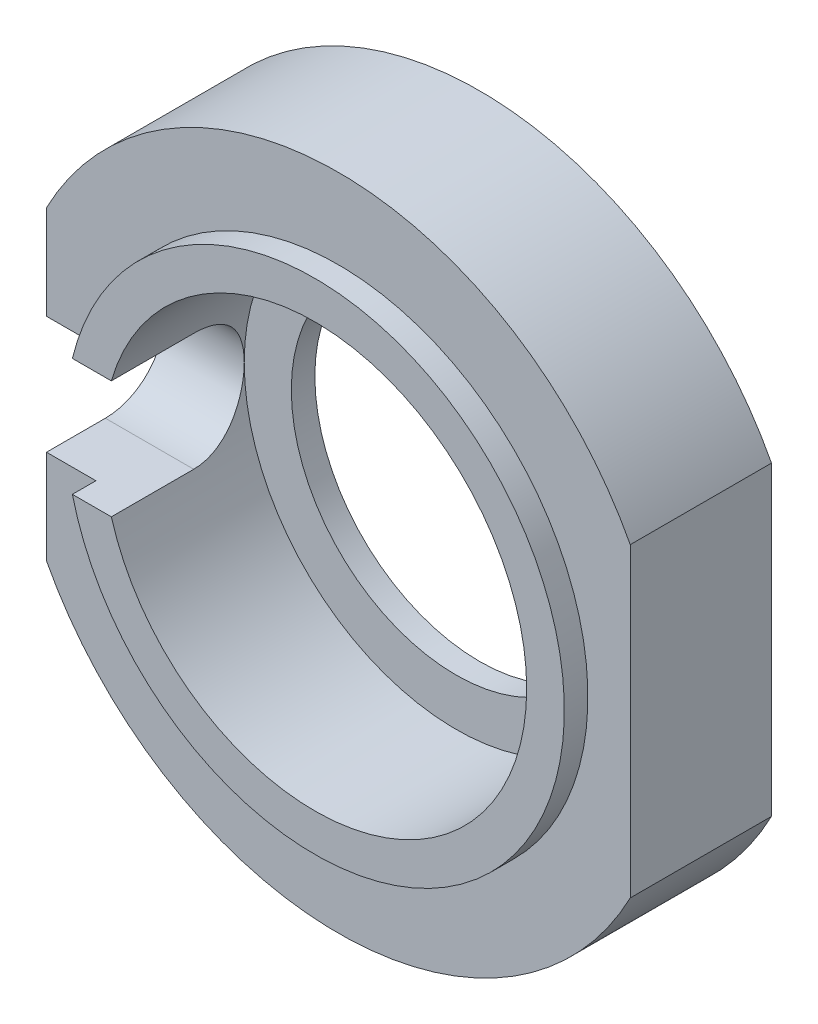
ISO-10303-21;
HEADER;
FILE_DESCRIPTION(('STEP AP214'),'2;1');
FILE_NAME('part.step','',(''),(''),'','','');
FILE_SCHEMA(('AUTOMOTIVE_DESIGN { 1 0 10303 214 1 1 1 1 }'));
ENDSEC;
DATA;
#1=APPLICATION_CONTEXT('core data for automotive mechanical design processes');
#2=APPLICATION_PROTOCOL_DEFINITION('international standard','automotive_design',2000,#1);
#3=PRODUCT_CONTEXT('',#1,'mechanical');
#4=PRODUCT('Part','Part','',(#3));
#5=PRODUCT_RELATED_PRODUCT_CATEGORY('part','',(#4));
#6=PRODUCT_DEFINITION_FORMATION('','',#4);
#7=PRODUCT_DEFINITION_CONTEXT('part definition',#1,'design');
#8=PRODUCT_DEFINITION('design','',#6,#7);
#9=PRODUCT_DEFINITION_SHAPE('','',#8);
#10=(LENGTH_UNIT() NAMED_UNIT(*) SI_UNIT(.MILLI.,.METRE.));
#11=(NAMED_UNIT(*) PLANE_ANGLE_UNIT() SI_UNIT($,.RADIAN.));
#12=(NAMED_UNIT(*) SI_UNIT($,.STERADIAN.) SOLID_ANGLE_UNIT());
#13=UNCERTAINTY_MEASURE_WITH_UNIT(LENGTH_MEASURE(1.E-05),#10,'distance_accuracy_value','');
#14=(GEOMETRIC_REPRESENTATION_CONTEXT(3) GLOBAL_UNCERTAINTY_ASSIGNED_CONTEXT((#13)) GLOBAL_UNIT_ASSIGNED_CONTEXT((#10,
#11,#12)) REPRESENTATION_CONTEXT('',''));
#15=CARTESIAN_POINT('',(0.,0.,0.));
#16=DIRECTION('',(0.,0.,1.));
#17=DIRECTION('',(1.,0.,0.));
#18=AXIS2_PLACEMENT_3D('',#15,#16,#17);
#19=CARTESIAN_POINT('',(0.,0.,-3.));
#20=DIRECTION('',(0.,0.,1.));
#21=DIRECTION('',(1.,0.,0.));
#22=AXIS2_PLACEMENT_3D('',#19,#20,#21);
#23=CYLINDRICAL_SURFACE('',#22,7.);
#24=DIRECTION('',(0.,0.,1.));
#25=VECTOR('',#24,1.);
#26=CARTESIAN_POINT('',(-6.2,3.24961536185439,-3.));
#27=LINE('',#26,#25);
#28=CARTESIAN_POINT('',(-6.2,3.24961536185439,0.));
#29=VERTEX_POINT('',#28);
#30=CARTESIAN_POINT('',(-6.2,3.24961536185439,-3.));
#31=VERTEX_POINT('',#30);
#32=EDGE_CURVE('E134',#29,#31,#27,.F.);
#33=ORIENTED_EDGE('',*,*,#32,.F.);
#34=CARTESIAN_POINT('',(0.,0.,0.));
#35=DIRECTION('',(0.,0.,1.));
#36=DIRECTION('',(1.,0.,0.));
#37=AXIS2_PLACEMENT_3D('',#34,#35,#36);
#38=CIRCLE('',#37,7.);
#39=CARTESIAN_POINT('',(6.2,3.24961536185438,0.));
#40=VERTEX_POINT('',#39);
#41=EDGE_CURVE('E178',#40,#29,#38,.T.);
#42=ORIENTED_EDGE('',*,*,#41,.F.);
#43=DIRECTION('',(0.,0.,1.));
#44=VECTOR('',#43,1.);
#45=CARTESIAN_POINT('',(6.2,3.24961536185438,-3.));
#46=LINE('',#45,#44);
#47=CARTESIAN_POINT('',(6.2,3.24961536185438,-3.));
#48=VERTEX_POINT('',#47);
#49=EDGE_CURVE('E78',#40,#48,#46,.F.);
#50=ORIENTED_EDGE('',*,*,#49,.T.);
#51=CARTESIAN_POINT('',(0.,0.,-3.));
#52=DIRECTION('',(0.,0.,1.));
#53=DIRECTION('',(1.,0.,0.));
#54=AXIS2_PLACEMENT_3D('',#51,#52,#53);
#55=CIRCLE('',#54,7.);
#56=EDGE_CURVE('E154',#48,#31,#55,.T.);
#57=ORIENTED_EDGE('',*,*,#56,.T.);
#58=EDGE_LOOP('',(#33,#42,#50,#57));
#59=FACE_BOUND('',#58,.T.);
#60=ADVANCED_FACE('F54',(#59),#23,.T.);
#61=DIRECTION('',(0.,0.,1.));
#62=VECTOR('',#61,1.);
#63=CARTESIAN_POINT('',(-6.2,-3.24961536185439,-3.));
#64=LINE('',#63,#62);
#65=CARTESIAN_POINT('',(-6.2,-3.24961536185438,-3.));
#66=VERTEX_POINT('',#65);
#67=CARTESIAN_POINT('',(-6.2,-3.24961536185438,0.));
#68=VERTEX_POINT('',#67);
#69=EDGE_CURVE('E147',#66,#68,#64,.T.);
#70=ORIENTED_EDGE('',*,*,#69,.F.);
#71=CARTESIAN_POINT('',(6.2,-3.24961536185439,-3.));
#72=VERTEX_POINT('',#71);
#73=EDGE_CURVE('E155',#66,#72,#55,.T.);
#74=ORIENTED_EDGE('',*,*,#73,.T.);
#75=DIRECTION('',(0.,0.,1.));
#76=VECTOR('',#75,1.);
#77=CARTESIAN_POINT('',(6.2,-3.24961536185439,-3.));
#78=LINE('',#77,#76);
#79=CARTESIAN_POINT('',(6.2,-3.24961536185439,0.));
#80=VERTEX_POINT('',#79);
#81=EDGE_CURVE('E256',#72,#80,#78,.T.);
#82=ORIENTED_EDGE('',*,*,#81,.T.);
#83=EDGE_CURVE('E168',#68,#80,#38,.T.);
#84=ORIENTED_EDGE('',*,*,#83,.F.);
#85=EDGE_LOOP('',(#70,#74,#82,#84));
#86=FACE_BOUND('',#85,.T.);
#87=ADVANCED_FACE('F293',(#86),#23,.T.);
#88=CARTESIAN_POINT('',(0.,0.,-3.));
#89=DIRECTION('',(0.,0.,1.));
#90=DIRECTION('',(1.,0.,0.));
#91=AXIS2_PLACEMENT_3D('',#88,#89,#90);
#92=PLANE('',#91);
#93=CARTESIAN_POINT('',(0.,0.,-3.));
#94=DIRECTION('',(0.,0.,-1.));
#95=DIRECTION('',(-1.,0.,0.));
#96=AXIS2_PLACEMENT_3D('',#93,#94,#95);
#97=CIRCLE('',#96,3.5);
#98=CARTESIAN_POINT('',(-3.5,0.,-3.));
#99=VERTEX_POINT('',#98);
#100=EDGE_CURVE('E199',#99,#99,#97,.T.);
#101=ORIENTED_EDGE('',*,*,#100,.F.);
#102=EDGE_LOOP('',(#101));
#103=FACE_BOUND('',#102,.T.);
#104=ORIENTED_EDGE('',*,*,#73,.F.);
#105=DIRECTION('',(0.,-1.,0.));
#106=VECTOR('',#105,1.);
#107=CARTESIAN_POINT('',(-6.2,12.06652293587,-3.));
#108=LINE('',#107,#106);
#109=EDGE_CURVE('E137',#31,#66,#108,.T.);
#110=ORIENTED_EDGE('',*,*,#109,.F.);
#111=ORIENTED_EDGE('',*,*,#56,.F.);
#112=DIRECTION('',(0.,-1.,0.));
#113=VECTOR('',#112,1.);
#114=CARTESIAN_POINT('',(6.2,12.7025152736224,-3.));
#115=LINE('',#114,#113);
#116=EDGE_CURVE('E146',#48,#72,#115,.T.);
#117=ORIENTED_EDGE('',*,*,#116,.T.);
#118=EDGE_LOOP('',(#104,#110,#111,#117));
#119=FACE_BOUND('',#118,.T.);
#120=ADVANCED_FACE('F152',(#103,#119),#92,.F.);
#121=CARTESIAN_POINT('',(0.,0.,0.));
#122=DIRECTION('',(0.,0.,1.));
#123=DIRECTION('',(1.,0.,0.));
#124=AXIS2_PLACEMENT_3D('',#121,#122,#123);
#125=PLANE('',#124);
#126=DIRECTION('',(0.,1.,0.));
#127=VECTOR('',#126,1.);
#128=CARTESIAN_POINT('',(-6.2,0.,0.));
#129=LINE('',#128,#127);
#130=CARTESIAN_POINT('',(-6.2,-1.25,0.));
#131=VERTEX_POINT('',#130);
#132=EDGE_CURVE('E262',#68,#131,#129,.T.);
#133=ORIENTED_EDGE('',*,*,#132,.F.);
#134=ORIENTED_EDGE('',*,*,#83,.T.);
#135=DIRECTION('',(0.,1.,0.));
#136=VECTOR('',#135,1.);
#137=CARTESIAN_POINT('',(6.2,0.,0.));
#138=LINE('',#137,#136);
#139=EDGE_CURVE('E64',#80,#40,#138,.T.);
#140=ORIENTED_EDGE('',*,*,#139,.T.);
#141=ORIENTED_EDGE('',*,*,#41,.T.);
#142=CARTESIAN_POINT('',(-6.2,1.25,0.));
#143=VERTEX_POINT('',#142);
#144=EDGE_CURVE('E140',#143,#29,#129,.T.);
#145=ORIENTED_EDGE('',*,*,#144,.F.);
#146=DIRECTION('',(-1.,0.,0.));
#147=VECTOR('',#146,1.);
#148=CARTESIAN_POINT('',(0.,1.25,0.));
#149=LINE('',#148,#147);
#150=CARTESIAN_POINT('',(-5.15048541401682,1.25,0.));
#151=VERTEX_POINT('',#150);
#152=EDGE_CURVE('E191',#151,#143,#149,.T.);
#153=ORIENTED_EDGE('',*,*,#152,.F.);
#154=CARTESIAN_POINT('',(0.,0.,0.));
#155=DIRECTION('',(0.,0.,1.));
#156=DIRECTION('',(1.,0.,0.));
#157=AXIS2_PLACEMENT_3D('',#154,#155,#156);
#158=CIRCLE('',#157,5.3);
#159=CARTESIAN_POINT('',(-5.15048541401682,-1.25,0.));
#160=VERTEX_POINT('',#159);
#161=EDGE_CURVE('E159',#160,#151,#158,.T.);
#162=ORIENTED_EDGE('',*,*,#161,.F.);
#163=DIRECTION('',(-1.,0.,0.));
#164=VECTOR('',#163,1.);
#165=CARTESIAN_POINT('',(0.,-1.25,0.));
#166=LINE('',#165,#164);
#167=EDGE_CURVE('E187',#160,#131,#166,.T.);
#168=ORIENTED_EDGE('',*,*,#167,.T.);
#169=EDGE_LOOP('',(#133,#134,#140,#141,#145,#153,#162,#168));
#170=FACE_BOUND('',#169,.T.);
#171=ADVANCED_FACE('F205',(#170),#125,.T.);
#172=CARTESIAN_POINT('',(0.,0.,0.5));
#173=DIRECTION('',(0.,0.,-1.));
#174=DIRECTION('',(-1.,0.,0.));
#175=AXIS2_PLACEMENT_3D('',#172,#173,#174);
#176=CYLINDRICAL_SURFACE('',#175,4.5);
#177=CARTESIAN_POINT('',(-4.32290411644765,-1.25,-1.25));
#178=CARTESIAN_POINT('',(-4.32290146436676,-1.250000576045,-1.28443902151534));
#179=CARTESIAN_POINT('',(-4.32331618408268,-1.24857583471195,-1.31886083039536));
#180=CARTESIAN_POINT('',(-4.32495310948487,-1.24289726955145,-1.3874442118807));
#181=CARTESIAN_POINT('',(-4.32617515519048,-1.23864400622614,-1.42160583468842));
#182=CARTESIAN_POINT('',(-4.33100149833611,-1.22170857228189,-1.5231684082525));
#183=CARTESIAN_POINT('',(-4.33576634319415,-1.20485043734851,-1.58986696249564));
#184=CARTESIAN_POINT('',(-4.34782862393349,-1.16056251821539,-1.71934348359845));
#185=CARTESIAN_POINT('',(-4.35512547838519,-1.13313516088422,-1.78212234664163));
#186=CARTESIAN_POINT('',(-4.37142497842244,-1.06852719338263,-1.90222678997382));
#187=CARTESIAN_POINT('',(-4.38042826125777,-1.03134293758884,-1.95955032096867));
#188=CARTESIAN_POINT('',(-4.39939714110305,-0.947208740400632,-2.0686303119187));
#189=CARTESIAN_POINT('',(-4.4093808433702,-0.900042882492583,-2.12021704718377));
#190=CARTESIAN_POINT('',(-4.42903068956963,-0.797744375711472,-2.21486290368673));
#191=CARTESIAN_POINT('',(-4.43869678111203,-0.742610420517771,-2.25792062389568));
#192=CARTESIAN_POINT('',(-4.4568262221146,-0.624748847501625,-2.33500318468976));
#193=CARTESIAN_POINT('',(-4.46526557805168,-0.561905279407677,-2.36885686402257));
#194=CARTESIAN_POINT('',(-4.47978037147462,-0.431147068581119,-2.42545066447839));
#195=CARTESIAN_POINT('',(-4.48585635069242,-0.363233592229249,-2.44819333276768));
#196=CARTESIAN_POINT('',(-4.49483154375068,-0.226043909478742,-2.48136530042189));
#197=CARTESIAN_POINT('',(-4.49780562679107,-0.156842976341786,-2.49208529277897));
#198=CARTESIAN_POINT('',(-4.50050434231718,-0.0175637350726412,-2.50182374718203));
#199=CARTESIAN_POINT('',(-4.50022949353404,0.0525144312139211,-2.50084407721993));
#200=CARTESIAN_POINT('',(-4.49651542268428,0.189527464729258,-2.48741219200865));
#201=CARTESIAN_POINT('',(-4.49316295627681,0.256495880174801,-2.47527449984516));
#202=CARTESIAN_POINT('',(-4.48377373992802,0.387404386211101,-2.4403811972799));
#203=CARTESIAN_POINT('',(-4.47773685771609,0.451344327406483,-2.41762506366747));
#204=CARTESIAN_POINT('',(-4.46353118905257,0.575167349566246,-2.36190872708191));
#205=CARTESIAN_POINT('',(-4.45534060663725,0.635000577901014,-2.32884351898761));
#206=CARTESIAN_POINT('',(-4.43770593865296,0.748373249601415,-2.25352937127713));
#207=CARTESIAN_POINT('',(-4.42826161351248,0.801911486391908,-2.211278675465));
#208=CARTESIAN_POINT('',(-4.40876934232228,0.903048023877687,-2.11714089157013));
#209=CARTESIAN_POINT('',(-4.39871176449087,0.950390721090147,-2.06498088801708));
#210=CARTESIAN_POINT('',(-4.37940385930509,1.03573266388548,-1.95334513077325));
#211=CARTESIAN_POINT('',(-4.37015375862718,1.07372929122919,-1.89386733403631));
#212=CARTESIAN_POINT('',(-4.35346480631467,1.13952154646574,-1.76868204304441));
#213=CARTESIAN_POINT('',(-4.34604045960407,1.16723631936365,-1.70293007972026));
#214=CARTESIAN_POINT('',(-4.33402454738315,1.21109743492695,-1.56747799244878));
#215=CARTESIAN_POINT('',(-4.329428707483,1.22726123919972,-1.49778400053626));
#216=CARTESIAN_POINT('',(-4.32533224221935,1.24157759886207,-1.39788311805461));
#217=CARTESIAN_POINT('',(-4.32442341010474,1.24473608920077,-1.36837911678992));
#218=CARTESIAN_POINT('',(-4.32320943811857,1.24894515709783,-1.30925491623904));
#219=CARTESIAN_POINT('',(-4.32290336202703,1.24999900369232,-1.2796349688701));
#220=CARTESIAN_POINT('',(-4.32290411644765,1.25,-1.25));
#221=B_SPLINE_CURVE_WITH_KNOTS('',3,(#177,#178,#179,#180,#181,#182,#183,#184,#185,#186,#187,
#188,#189,#190,#191,#192,#193,#194,#195,#196,#197,#198,#199,#200,#201,#202,#203,#204,#205,#206,
#207,#208,#209,#210,#211,#212,#213,#214,#215,#216,#217,#218,#219,#220),.UNSPECIFIED.,.F.,.F.,(4,
2,2,2,2,2,2,2,2,2,2,2,2,2,2,2,2,2,2,2,2,4),(0.,0.103251330397729,0.206482206525295,
0.412292932386806,0.618056428827713,0.823896917670529,1.03475400760892,1.24564570556978,
1.46022599591408,1.67475707125433,1.88398102562563,2.09317157532102,2.2966404702467,
2.50011939191108,2.70574260990256,2.91140517613004,3.12388242695943,3.33641913425316,
3.55059344766321,3.7644433047568,3.85343647289299,3.94229130462277),.UNSPECIFIED.);
#222=CARTESIAN_POINT('',(-4.50000000000113,4.31042943698656E-13,-2.50000000000406));
#223=VERTEX_POINT('',#222);
#224=CARTESIAN_POINT('',(-4.32290411644765,1.25,-1.25));
#225=VERTEX_POINT('',#224);
#226=EDGE_CURVE('E212',#223,#225,#221,.T.);
#227=ORIENTED_EDGE('',*,*,#226,.F.);
#228=CARTESIAN_POINT('',(0.,0.,-2.5));
#229=DIRECTION('',(0.,0.,-1.));
#230=DIRECTION('',(-1.,0.,0.));
#231=AXIS2_PLACEMENT_3D('',#228,#229,#230);
#232=CIRCLE('',#231,4.5);
#233=EDGE_CURVE('E198',#223,#223,#232,.T.);
#234=ORIENTED_EDGE('',*,*,#233,.T.);
#235=CARTESIAN_POINT('',(-4.32290411644765,-1.25,-1.25));
#236=VERTEX_POINT('',#235);
#237=EDGE_CURVE('E171',#236,#223,#221,.T.);
#238=ORIENTED_EDGE('',*,*,#237,.F.);
#239=DIRECTION('',(0.,0.,-1.));
#240=VECTOR('',#239,1.);
#241=CARTESIAN_POINT('',(-4.32290411644765,-1.25,0.5));
#242=LINE('',#241,#240);
#243=CARTESIAN_POINT('',(-4.32290411644765,-1.25,0.5));
#244=VERTEX_POINT('',#243);
#245=EDGE_CURVE('E234',#236,#244,#242,.F.);
#246=ORIENTED_EDGE('',*,*,#245,.T.);
#247=CARTESIAN_POINT('',(0.,0.,0.5));
#248=DIRECTION('',(0.,0.,1.));
#249=DIRECTION('',(1.,0.,0.));
#250=AXIS2_PLACEMENT_3D('',#247,#248,#249);
#251=CIRCLE('',#250,4.5);
#252=CARTESIAN_POINT('',(-4.32290411644765,1.25,0.5));
#253=VERTEX_POINT('',#252);
#254=EDGE_CURVE('E165',#244,#253,#251,.T.);
#255=ORIENTED_EDGE('',*,*,#254,.T.);
#256=DIRECTION('',(0.,0.,-1.));
#257=VECTOR('',#256,1.);
#258=CARTESIAN_POINT('',(-4.32290411644765,1.25,0.5));
#259=LINE('',#258,#257);
#260=EDGE_CURVE('E219',#225,#253,#259,.F.);
#261=ORIENTED_EDGE('',*,*,#260,.F.);
#262=EDGE_LOOP('',(#227,#234,#238,#246,#255,#261));
#263=FACE_BOUND('',#262,.T.);
#264=ADVANCED_FACE('F56',(#263),#176,.F.);
#265=CARTESIAN_POINT('',(0.,0.,0.5));
#266=DIRECTION('',(0.,0.,-1.));
#267=DIRECTION('',(-1.,0.,0.));
#268=AXIS2_PLACEMENT_3D('',#265,#266,#267);
#269=CYLINDRICAL_SURFACE('',#268,5.3);
#270=ORIENTED_EDGE('',*,*,#161,.T.);
#271=DIRECTION('',(0.,0.,-1.));
#272=VECTOR('',#271,1.);
#273=CARTESIAN_POINT('',(-5.15048541401682,1.25,0.5));
#274=LINE('',#273,#272);
#275=CARTESIAN_POINT('',(-5.15048541401682,1.25,0.5));
#276=VERTEX_POINT('',#275);
#277=EDGE_CURVE('E229',#151,#276,#274,.F.);
#278=ORIENTED_EDGE('',*,*,#277,.T.);
#279=CARTESIAN_POINT('',(0.,0.,0.5));
#280=DIRECTION('',(0.,0.,1.));
#281=DIRECTION('',(1.,0.,0.));
#282=AXIS2_PLACEMENT_3D('',#279,#280,#281);
#283=CIRCLE('',#282,5.3);
#284=CARTESIAN_POINT('',(-5.15048541401682,-1.25,0.5));
#285=VERTEX_POINT('',#284);
#286=EDGE_CURVE('E183',#285,#276,#283,.T.);
#287=ORIENTED_EDGE('',*,*,#286,.F.);
#288=DIRECTION('',(0.,0.,-1.));
#289=VECTOR('',#288,1.);
#290=CARTESIAN_POINT('',(-5.15048541401682,-1.25,0.5));
#291=LINE('',#290,#289);
#292=EDGE_CURVE('E241',#160,#285,#291,.F.);
#293=ORIENTED_EDGE('',*,*,#292,.F.);
#294=EDGE_LOOP('',(#270,#278,#287,#293));
#295=FACE_BOUND('',#294,.T.);
#296=ADVANCED_FACE('F304',(#295),#269,.T.);
#297=CARTESIAN_POINT('',(0.,0.,0.5));
#298=DIRECTION('',(0.,0.,1.));
#299=DIRECTION('',(1.,0.,0.));
#300=AXIS2_PLACEMENT_3D('',#297,#298,#299);
#301=PLANE('',#300);
#302=DIRECTION('',(-1.,0.,0.));
#303=VECTOR('',#302,1.);
#304=CARTESIAN_POINT('',(0.,1.25,0.5));
#305=LINE('',#304,#303);
#306=EDGE_CURVE('E224',#253,#276,#305,.T.);
#307=ORIENTED_EDGE('',*,*,#306,.F.);
#308=ORIENTED_EDGE('',*,*,#254,.F.);
#309=DIRECTION('',(-1.,0.,0.));
#310=VECTOR('',#309,1.);
#311=CARTESIAN_POINT('',(0.,-1.25,0.5));
#312=LINE('',#311,#310);
#313=EDGE_CURVE('E237',#244,#285,#312,.T.);
#314=ORIENTED_EDGE('',*,*,#313,.T.);
#315=ORIENTED_EDGE('',*,*,#286,.T.);
#316=EDGE_LOOP('',(#307,#308,#314,#315));
#317=FACE_BOUND('',#316,.T.);
#318=ADVANCED_FACE('F302',(#317),#301,.T.);
#319=CARTESIAN_POINT('',(-7.,1.25,-1.25));
#320=DIRECTION('',(0.,1.,0.));
#321=DIRECTION('',(0.,0.,1.));
#322=AXIS2_PLACEMENT_3D('',#319,#320,#321);
#323=PLANE('',#322);
#324=ORIENTED_EDGE('',*,*,#152,.T.);
#325=DIRECTION('',(0.,0.,-1.));
#326=VECTOR('',#325,1.);
#327=CARTESIAN_POINT('',(-6.2,1.25,-1.25));
#328=LINE('',#327,#326);
#329=CARTESIAN_POINT('',(-6.2,1.25,-1.25));
#330=VERTEX_POINT('',#329);
#331=EDGE_CURVE('E264',#143,#330,#328,.T.);
#332=ORIENTED_EDGE('',*,*,#331,.T.);
#333=DIRECTION('',(1.,0.,0.));
#334=VECTOR('',#333,1.);
#335=CARTESIAN_POINT('',(-7.,1.25,-1.25));
#336=LINE('',#335,#334);
#337=EDGE_CURVE('E247',#330,#225,#336,.T.);
#338=ORIENTED_EDGE('',*,*,#337,.T.);
#339=ORIENTED_EDGE('',*,*,#260,.T.);
#340=ORIENTED_EDGE('',*,*,#306,.T.);
#341=ORIENTED_EDGE('',*,*,#277,.F.);
#342=EDGE_LOOP('',(#324,#332,#338,#339,#340,#341));
#343=FACE_BOUND('',#342,.T.);
#344=ADVANCED_FACE('F269',(#343),#323,.F.);
#345=CARTESIAN_POINT('',(-7.,-1.25,-1.25));
#346=DIRECTION('',(0.,1.,0.));
#347=DIRECTION('',(0.,0.,1.));
#348=AXIS2_PLACEMENT_3D('',#345,#346,#347);
#349=PLANE('',#348);
#350=DIRECTION('',(0.,0.,-1.));
#351=VECTOR('',#350,1.);
#352=CARTESIAN_POINT('',(-6.2,-1.25,-1.25));
#353=LINE('',#352,#351);
#354=CARTESIAN_POINT('',(-6.2,-1.25,-1.25));
#355=VERTEX_POINT('',#354);
#356=EDGE_CURVE('E71',#131,#355,#353,.T.);
#357=ORIENTED_EDGE('',*,*,#356,.F.);
#358=ORIENTED_EDGE('',*,*,#167,.F.);
#359=ORIENTED_EDGE('',*,*,#292,.T.);
#360=ORIENTED_EDGE('',*,*,#313,.F.);
#361=ORIENTED_EDGE('',*,*,#245,.F.);
#362=DIRECTION('',(1.,0.,0.));
#363=VECTOR('',#362,1.);
#364=CARTESIAN_POINT('',(-7.,-1.25,-1.25));
#365=LINE('',#364,#363);
#366=EDGE_CURVE('E244',#355,#236,#365,.T.);
#367=ORIENTED_EDGE('',*,*,#366,.F.);
#368=EDGE_LOOP('',(#357,#358,#359,#360,#361,#367));
#369=FACE_BOUND('',#368,.T.);
#370=ADVANCED_FACE('F275',(#369),#349,.T.);
#371=CARTESIAN_POINT('',(-7.,0.,-1.25));
#372=DIRECTION('',(1.,0.,0.));
#373=DIRECTION('',(0.,0.,-1.));
#374=AXIS2_PLACEMENT_3D('',#371,#372,#373);
#375=CYLINDRICAL_SURFACE('',#374,1.25);
#376=ORIENTED_EDGE('',*,*,#337,.F.);
#377=CARTESIAN_POINT('',(-6.2,0.,-1.25));
#378=DIRECTION('',(1.,0.,0.));
#379=DIRECTION('',(0.,1.,0.));
#380=AXIS2_PLACEMENT_3D('',#377,#378,#379);
#381=CIRCLE('',#380,1.25);
#382=EDGE_CURVE('E12',#330,#355,#381,.F.);
#383=ORIENTED_EDGE('',*,*,#382,.T.);
#384=ORIENTED_EDGE('',*,*,#366,.T.);
#385=ORIENTED_EDGE('',*,*,#237,.T.);
#386=ORIENTED_EDGE('',*,*,#226,.T.);
#387=EDGE_LOOP('',(#376,#383,#384,#385,#386));
#388=FACE_BOUND('',#387,.T.);
#389=ADVANCED_FACE('F271',(#388),#375,.F.);
#390=CARTESIAN_POINT('',(0.,0.,-2.5));
#391=DIRECTION('',(0.,0.,-1.));
#392=DIRECTION('',(-1.,0.,0.));
#393=AXIS2_PLACEMENT_3D('',#390,#391,#392);
#394=PLANE('',#393);
#395=CARTESIAN_POINT('',(0.,0.,-2.5));
#396=DIRECTION('',(0.,0.,-1.));
#397=DIRECTION('',(-1.,0.,0.));
#398=AXIS2_PLACEMENT_3D('',#395,#396,#397);
#399=CIRCLE('',#398,3.5);
#400=CARTESIAN_POINT('',(-3.5,0.,-2.5));
#401=VERTEX_POINT('',#400);
#402=EDGE_CURVE('E195',#401,#401,#399,.T.);
#403=ORIENTED_EDGE('',*,*,#402,.T.);
#404=EDGE_LOOP('',(#403));
#405=FACE_BOUND('',#404,.T.);
#406=ORIENTED_EDGE('',*,*,#233,.F.);
#407=EDGE_LOOP('',(#406));
#408=FACE_BOUND('',#407,.T.);
#409=ADVANCED_FACE('F279',(#405,#408),#394,.F.);
#410=CARTESIAN_POINT('',(0.,0.,0.5));
#411=DIRECTION('',(0.,0.,-1.));
#412=DIRECTION('',(-1.,0.,0.));
#413=AXIS2_PLACEMENT_3D('',#410,#411,#412);
#414=CYLINDRICAL_SURFACE('',#413,3.5);
#415=ORIENTED_EDGE('',*,*,#100,.T.);
#416=EDGE_LOOP('',(#415));
#417=FACE_BOUND('',#416,.T.);
#418=ORIENTED_EDGE('',*,*,#402,.F.);
#419=EDGE_LOOP('',(#418));
#420=FACE_BOUND('',#419,.T.);
#421=ADVANCED_FACE('F281',(#417,#420),#414,.F.);
#422=CARTESIAN_POINT('',(6.2,12.7025152736224,0.5));
#423=DIRECTION('',(1.,0.,0.));
#424=DIRECTION('',(0.,1.,0.));
#425=AXIS2_PLACEMENT_3D('',#422,#423,#424);
#426=PLANE('',#425);
#427=ORIENTED_EDGE('',*,*,#139,.F.);
#428=ORIENTED_EDGE('',*,*,#81,.F.);
#429=ORIENTED_EDGE('',*,*,#116,.F.);
#430=ORIENTED_EDGE('',*,*,#49,.F.);
#431=EDGE_LOOP('',(#427,#428,#429,#430));
#432=FACE_BOUND('',#431,.T.);
#433=ADVANCED_FACE('F288',(#432),#426,.T.);
#434=CARTESIAN_POINT('',(-6.2,12.06652293587,0.5));
#435=DIRECTION('',(1.,0.,0.));
#436=DIRECTION('',(0.,1.,0.));
#437=AXIS2_PLACEMENT_3D('',#434,#435,#436);
#438=PLANE('',#437);
#439=ORIENTED_EDGE('',*,*,#32,.T.);
#440=ORIENTED_EDGE('',*,*,#109,.T.);
#441=ORIENTED_EDGE('',*,*,#69,.T.);
#442=ORIENTED_EDGE('',*,*,#132,.T.);
#443=ORIENTED_EDGE('',*,*,#356,.T.);
#444=ORIENTED_EDGE('',*,*,#382,.F.);
#445=ORIENTED_EDGE('',*,*,#331,.F.);
#446=ORIENTED_EDGE('',*,*,#144,.T.);
#447=EDGE_LOOP('',(#439,#440,#441,#442,#443,#444,#445,#446));
#448=FACE_BOUND('',#447,.T.);
#449=ADVANCED_FACE('F136',(#448),#438,.F.);
#450=CLOSED_SHELL('',(#60,#87,#120,#171,#264,#296,#318,#344,#370,#389,#409,#421,#433,#449));
#451=MANIFOLD_SOLID_BREP('B2',#450);
#452=ADVANCED_BREP_SHAPE_REPRESENTATION('',(#18,#451),#14);
#453=SHAPE_DEFINITION_REPRESENTATION(#9,#452);
ENDSEC;
END-ISO-10303-21;
